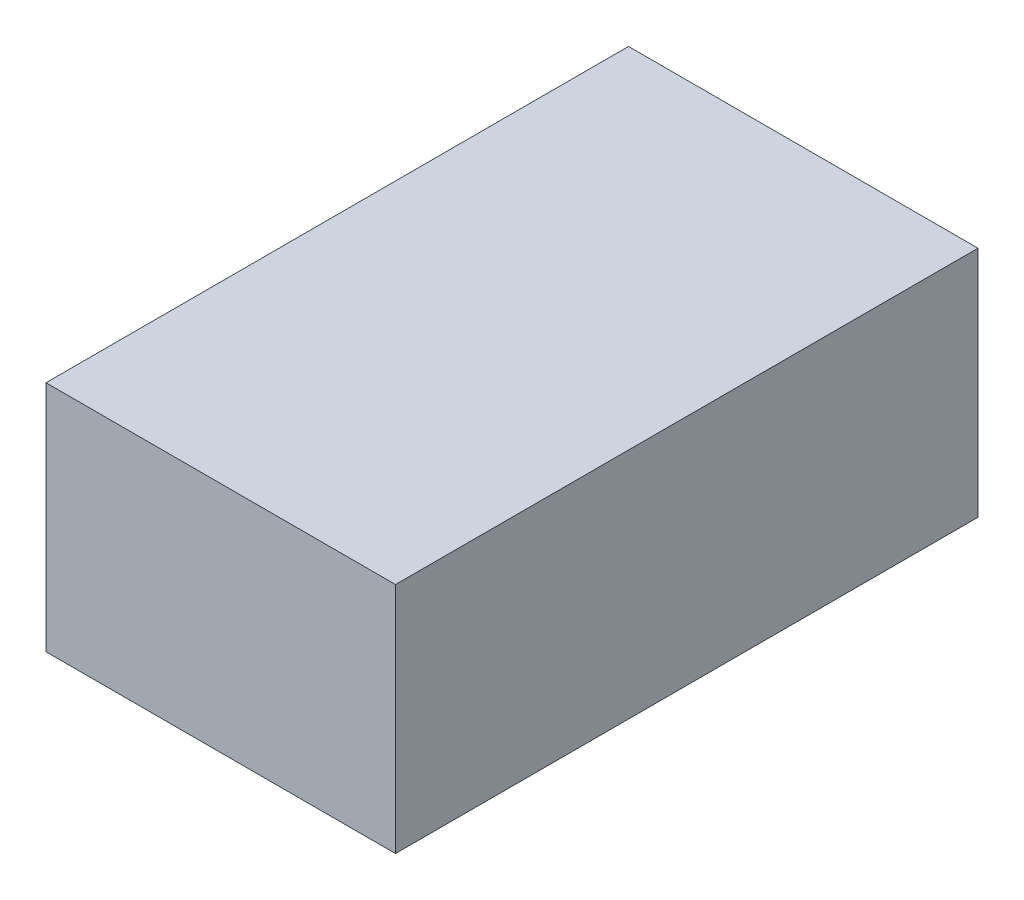
ISO-10303-21;
HEADER;
FILE_DESCRIPTION(('STEP AP214'),'2;1');
FILE_NAME('part.step','',(''),(''),'','','');
FILE_SCHEMA(('AUTOMOTIVE_DESIGN { 1 0 10303 214 1 1 1 1 }'));
ENDSEC;
DATA;
#1=APPLICATION_CONTEXT('core data for automotive mechanical design processes');
#2=APPLICATION_PROTOCOL_DEFINITION('international standard','automotive_design',2000,#1);
#3=PRODUCT_CONTEXT('',#1,'mechanical');
#4=PRODUCT('Part','Part','',(#3));
#5=PRODUCT_RELATED_PRODUCT_CATEGORY('part','',(#4));
#6=PRODUCT_DEFINITION_FORMATION('','',#4);
#7=PRODUCT_DEFINITION_CONTEXT('part definition',#1,'design');
#8=PRODUCT_DEFINITION('design','',#6,#7);
#9=PRODUCT_DEFINITION_SHAPE('','',#8);
#10=(LENGTH_UNIT() NAMED_UNIT(*) SI_UNIT(.MILLI.,.METRE.));
#11=(NAMED_UNIT(*) PLANE_ANGLE_UNIT() SI_UNIT($,.RADIAN.));
#12=(NAMED_UNIT(*) SI_UNIT($,.STERADIAN.) SOLID_ANGLE_UNIT());
#13=UNCERTAINTY_MEASURE_WITH_UNIT(LENGTH_MEASURE(1.E-05),#10,'distance_accuracy_value','');
#14=(GEOMETRIC_REPRESENTATION_CONTEXT(3) GLOBAL_UNCERTAINTY_ASSIGNED_CONTEXT((#13)) GLOBAL_UNIT_ASSIGNED_CONTEXT((#10,
#11,#12)) REPRESENTATION_CONTEXT('',''));
#15=CARTESIAN_POINT('',(0.,0.,0.));
#16=DIRECTION('',(0.,0.,1.));
#17=DIRECTION('',(1.,0.,0.));
#18=AXIS2_PLACEMENT_3D('',#15,#16,#17);
#19=CARTESIAN_POINT('',(0.3,0.4,-0.5));
#20=DIRECTION('',(-1.,0.,0.));
#21=DIRECTION('',(0.,0.,1.));
#22=AXIS2_PLACEMENT_3D('',#19,#20,#21);
#23=PLANE('',#22);
#24=DIRECTION('',(0.,0.,-1.));
#25=VECTOR('',#24,1.);
#26=CARTESIAN_POINT('',(0.3,0.,-0.5));
#27=LINE('',#26,#25);
#28=CARTESIAN_POINT('',(0.3,0.,0.5));
#29=VERTEX_POINT('',#28);
#30=CARTESIAN_POINT('',(0.3,0.,-0.5));
#31=VERTEX_POINT('',#30);
#32=EDGE_CURVE('E96',#29,#31,#27,.T.);
#33=ORIENTED_EDGE('',*,*,#32,.T.);
#34=DIRECTION('',(0.,-1.,0.));
#35=VECTOR('',#34,1.);
#36=CARTESIAN_POINT('',(0.3,0.4,-0.5));
#37=LINE('',#36,#35);
#38=CARTESIAN_POINT('',(0.3,0.4,-0.5));
#39=VERTEX_POINT('',#38);
#40=EDGE_CURVE('E11',#39,#31,#37,.T.);
#41=ORIENTED_EDGE('',*,*,#40,.F.);
#42=DIRECTION('',(0.,0.,-1.));
#43=VECTOR('',#42,1.);
#44=CARTESIAN_POINT('',(0.3,0.4,-0.5));
#45=LINE('',#44,#43);
#46=CARTESIAN_POINT('',(0.3,0.4,0.5));
#47=VERTEX_POINT('',#46);
#48=EDGE_CURVE('E84',#47,#39,#45,.T.);
#49=ORIENTED_EDGE('',*,*,#48,.F.);
#50=DIRECTION('',(0.,-1.,0.));
#51=VECTOR('',#50,1.);
#52=CARTESIAN_POINT('',(0.3,0.4,0.5));
#53=LINE('',#52,#51);
#54=EDGE_CURVE('E92',#47,#29,#53,.T.);
#55=ORIENTED_EDGE('',*,*,#54,.T.);
#56=EDGE_LOOP('',(#33,#41,#49,#55));
#57=FACE_BOUND('',#56,.T.);
#58=ADVANCED_FACE('F33',(#57),#23,.F.);
#59=CARTESIAN_POINT('',(-0.3,0.4,-0.5));
#60=DIRECTION('',(0.,0.,1.));
#61=DIRECTION('',(1.,0.,0.));
#62=AXIS2_PLACEMENT_3D('',#59,#60,#61);
#63=PLANE('',#62);
#64=DIRECTION('',(-1.,0.,0.));
#65=VECTOR('',#64,1.);
#66=CARTESIAN_POINT('',(-0.3,0.,-0.5));
#67=LINE('',#66,#65);
#68=CARTESIAN_POINT('',(-0.3,0.,-0.5));
#69=VERTEX_POINT('',#68);
#70=EDGE_CURVE('E88',#31,#69,#67,.T.);
#71=ORIENTED_EDGE('',*,*,#70,.T.);
#72=DIRECTION('',(0.,-1.,0.));
#73=VECTOR('',#72,1.);
#74=CARTESIAN_POINT('',(-0.3,0.4,-0.5));
#75=LINE('',#74,#73);
#76=CARTESIAN_POINT('',(-0.3,0.4,-0.5));
#77=VERTEX_POINT('',#76);
#78=EDGE_CURVE('E41',#77,#69,#75,.T.);
#79=ORIENTED_EDGE('',*,*,#78,.F.);
#80=DIRECTION('',(-1.,0.,0.));
#81=VECTOR('',#80,1.);
#82=CARTESIAN_POINT('',(-0.3,0.4,-0.5));
#83=LINE('',#82,#81);
#84=EDGE_CURVE('E79',#39,#77,#83,.T.);
#85=ORIENTED_EDGE('',*,*,#84,.F.);
#86=ORIENTED_EDGE('',*,*,#40,.T.);
#87=EDGE_LOOP('',(#71,#79,#85,#86));
#88=FACE_BOUND('',#87,.T.);
#89=ADVANCED_FACE('F87',(#88),#63,.F.);
#90=CARTESIAN_POINT('',(-0.3,0.4,-0.5));
#91=DIRECTION('',(1.,0.,0.));
#92=DIRECTION('',(0.,0.,-1.));
#93=AXIS2_PLACEMENT_3D('',#90,#91,#92);
#94=PLANE('',#93);
#95=DIRECTION('',(0.,0.,1.));
#96=VECTOR('',#95,1.);
#97=CARTESIAN_POINT('',(-0.3,0.,-0.5));
#98=LINE('',#97,#96);
#99=CARTESIAN_POINT('',(-0.3,0.,0.5));
#100=VERTEX_POINT('',#99);
#101=EDGE_CURVE('E66',#69,#100,#98,.T.);
#102=ORIENTED_EDGE('',*,*,#101,.T.);
#103=DIRECTION('',(0.,-1.,0.));
#104=VECTOR('',#103,1.);
#105=CARTESIAN_POINT('',(-0.3,0.4,0.5));
#106=LINE('',#105,#104);
#107=CARTESIAN_POINT('',(-0.3,0.4,0.5));
#108=VERTEX_POINT('',#107);
#109=EDGE_CURVE('E89',#108,#100,#106,.T.);
#110=ORIENTED_EDGE('',*,*,#109,.F.);
#111=DIRECTION('',(0.,0.,1.));
#112=VECTOR('',#111,1.);
#113=CARTESIAN_POINT('',(-0.3,0.4,-0.5));
#114=LINE('',#113,#112);
#115=EDGE_CURVE('E82',#77,#108,#114,.T.);
#116=ORIENTED_EDGE('',*,*,#115,.F.);
#117=ORIENTED_EDGE('',*,*,#78,.T.);
#118=EDGE_LOOP('',(#102,#110,#116,#117));
#119=FACE_BOUND('',#118,.T.);
#120=ADVANCED_FACE('F90',(#119),#94,.F.);
#121=CARTESIAN_POINT('',(-0.3,0.4,0.5));
#122=DIRECTION('',(0.,0.,-1.));
#123=DIRECTION('',(-1.,0.,0.));
#124=AXIS2_PLACEMENT_3D('',#121,#122,#123);
#125=PLANE('',#124);
#126=DIRECTION('',(1.,0.,0.));
#127=VECTOR('',#126,1.);
#128=CARTESIAN_POINT('',(-0.3,0.,0.5));
#129=LINE('',#128,#127);
#130=EDGE_CURVE('E72',#100,#29,#129,.T.);
#131=ORIENTED_EDGE('',*,*,#130,.T.);
#132=ORIENTED_EDGE('',*,*,#54,.F.);
#133=DIRECTION('',(1.,0.,0.));
#134=VECTOR('',#133,1.);
#135=CARTESIAN_POINT('',(-0.3,0.4,0.5));
#136=LINE('',#135,#134);
#137=EDGE_CURVE('E49',#108,#47,#136,.T.);
#138=ORIENTED_EDGE('',*,*,#137,.F.);
#139=ORIENTED_EDGE('',*,*,#109,.T.);
#140=EDGE_LOOP('',(#131,#132,#138,#139));
#141=FACE_BOUND('',#140,.T.);
#142=ADVANCED_FACE('F103',(#141),#125,.F.);
#143=CARTESIAN_POINT('',(0.,0.4,0.));
#144=DIRECTION('',(0.,1.,0.));
#145=DIRECTION('',(0.,0.,1.));
#146=AXIS2_PLACEMENT_3D('',#143,#144,#145);
#147=PLANE('',#146);
#148=ORIENTED_EDGE('',*,*,#48,.T.);
#149=ORIENTED_EDGE('',*,*,#84,.T.);
#150=ORIENTED_EDGE('',*,*,#115,.T.);
#151=ORIENTED_EDGE('',*,*,#137,.T.);
#152=EDGE_LOOP('',(#148,#149,#150,#151));
#153=FACE_BOUND('',#152,.T.);
#154=ADVANCED_FACE('F80',(#153),#147,.T.);
#155=CARTESIAN_POINT('',(0.,0.,0.));
#156=DIRECTION('',(0.,1.,0.));
#157=DIRECTION('',(0.,0.,1.));
#158=AXIS2_PLACEMENT_3D('',#155,#156,#157);
#159=PLANE('',#158);
#160=ORIENTED_EDGE('',*,*,#32,.F.);
#161=ORIENTED_EDGE('',*,*,#130,.F.);
#162=ORIENTED_EDGE('',*,*,#101,.F.);
#163=ORIENTED_EDGE('',*,*,#70,.F.);
#164=EDGE_LOOP('',(#160,#161,#162,#163));
#165=FACE_BOUND('',#164,.T.);
#166=ADVANCED_FACE('F106',(#165),#159,.F.);
#167=CLOSED_SHELL('',(#58,#89,#120,#142,#154,#166));
#168=MANIFOLD_SOLID_BREP('B2',#167);
#169=ADVANCED_BREP_SHAPE_REPRESENTATION('',(#18,#168),#14);
#170=SHAPE_DEFINITION_REPRESENTATION(#9,#169);
ENDSEC;
END-ISO-10303-21;
